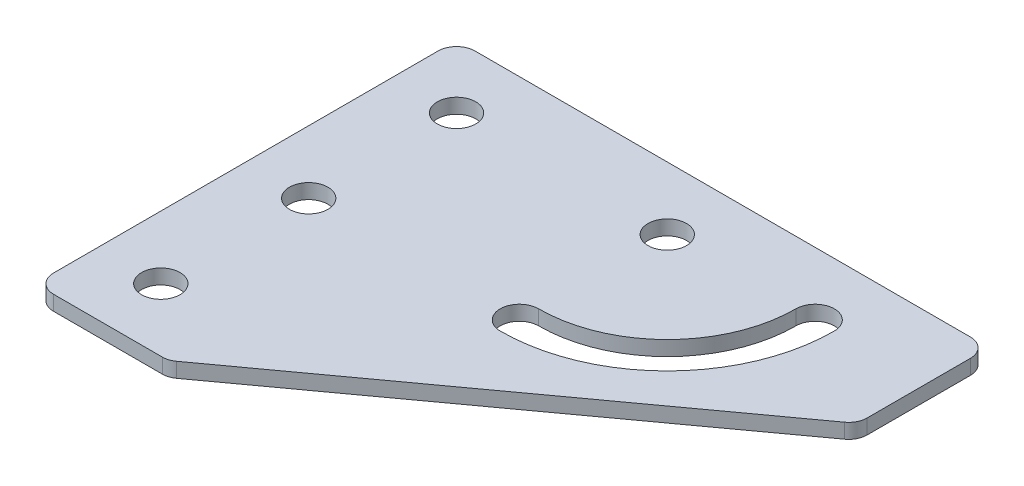
ISO-10303-21;
HEADER;
FILE_DESCRIPTION(('STEP AP214'),'2;1');
FILE_NAME('part.step','',(''),(''),'','','');
FILE_SCHEMA(('AUTOMOTIVE_DESIGN { 1 0 10303 214 1 1 1 1 }'));
ENDSEC;
DATA;
#1=APPLICATION_CONTEXT('core data for automotive mechanical design processes');
#2=APPLICATION_PROTOCOL_DEFINITION('international standard','automotive_design',2000,#1);
#3=PRODUCT_CONTEXT('',#1,'mechanical');
#4=PRODUCT('Part','Part','',(#3));
#5=PRODUCT_RELATED_PRODUCT_CATEGORY('part','',(#4));
#6=PRODUCT_DEFINITION_FORMATION('','',#4);
#7=PRODUCT_DEFINITION_CONTEXT('part definition',#1,'design');
#8=PRODUCT_DEFINITION('design','',#6,#7);
#9=PRODUCT_DEFINITION_SHAPE('','',#8);
#10=(LENGTH_UNIT() NAMED_UNIT(*) SI_UNIT(.MILLI.,.METRE.));
#11=(NAMED_UNIT(*) PLANE_ANGLE_UNIT() SI_UNIT($,.RADIAN.));
#12=(NAMED_UNIT(*) SI_UNIT($,.STERADIAN.) SOLID_ANGLE_UNIT());
#13=UNCERTAINTY_MEASURE_WITH_UNIT(LENGTH_MEASURE(1.E-05),#10,'distance_accuracy_value','');
#14=(GEOMETRIC_REPRESENTATION_CONTEXT(3) GLOBAL_UNCERTAINTY_ASSIGNED_CONTEXT((#13)) GLOBAL_UNIT_ASSIGNED_CONTEXT((#10,
#11,#12)) REPRESENTATION_CONTEXT('',''));
#15=CARTESIAN_POINT('',(0.,0.,0.));
#16=DIRECTION('',(0.,0.,1.));
#17=DIRECTION('',(1.,0.,0.));
#18=AXIS2_PLACEMENT_3D('',#15,#16,#17);
#19=CARTESIAN_POINT('',(0.,0.,0.));
#20=DIRECTION('',(0.,-1.,0.));
#21=DIRECTION('',(0.,0.,-1.));
#22=AXIS2_PLACEMENT_3D('',#19,#20,#21);
#23=PLANE('',#22);
#24=CARTESIAN_POINT('',(28.5,0.,20.));
#25=DIRECTION('',(0.,1.,0.));
#26=DIRECTION('',(0.,0.,1.));
#27=AXIS2_PLACEMENT_3D('',#24,#25,#26);
#28=CIRCLE('',#27,2.6);
#29=CARTESIAN_POINT('',(28.5,0.,17.4));
#30=VERTEX_POINT('',#29);
#31=CARTESIAN_POINT('',(28.5,0.,22.6));
#32=VERTEX_POINT('',#31);
#33=EDGE_CURVE('E122',#30,#32,#28,.T.);
#34=ORIENTED_EDGE('',*,*,#33,.T.);
#35=CARTESIAN_POINT('',(28.4999999999999,0.,0.));
#36=DIRECTION('',(0.,1.,0.));
#37=DIRECTION('',(0.,0.,1.));
#38=AXIS2_PLACEMENT_3D('',#35,#36,#37);
#39=CIRCLE('',#38,22.6);
#40=CARTESIAN_POINT('',(51.1,0.,0.));
#41=VERTEX_POINT('',#40);
#42=EDGE_CURVE('E134',#32,#41,#39,.T.);
#43=ORIENTED_EDGE('',*,*,#42,.T.);
#44=CARTESIAN_POINT('',(48.4999999999999,0.,0.));
#45=DIRECTION('',(0.,1.,0.));
#46=DIRECTION('',(0.,0.,1.));
#47=AXIS2_PLACEMENT_3D('',#44,#45,#46);
#48=CIRCLE('',#47,2.6);
#49=CARTESIAN_POINT('',(45.8999999999999,0.,0.));
#50=VERTEX_POINT('',#49);
#51=EDGE_CURVE('E138',#41,#50,#48,.T.);
#52=ORIENTED_EDGE('',*,*,#51,.T.);
#53=CARTESIAN_POINT('',(28.4999999999999,0.,0.));
#54=DIRECTION('',(0.,-1.,0.));
#55=DIRECTION('',(0.,0.,1.));
#56=AXIS2_PLACEMENT_3D('',#53,#54,#55);
#57=CIRCLE('',#56,17.4);
#58=EDGE_CURVE('E130',#50,#30,#57,.T.);
#59=ORIENTED_EDGE('',*,*,#58,.T.);
#60=EDGE_LOOP('',(#34,#43,#52,#59));
#61=FACE_BOUND('',#60,.T.);
#62=CARTESIAN_POINT('',(0.,0.,40.));
#63=DIRECTION('',(0.,1.,0.));
#64=DIRECTION('',(0.,0.,1.));
#65=AXIS2_PLACEMENT_3D('',#62,#63,#64);
#66=CIRCLE('',#65,2.6);
#67=CARTESIAN_POINT('',(0.,0.,42.6));
#68=VERTEX_POINT('',#67);
#69=EDGE_CURVE('E161',#68,#68,#66,.T.);
#70=ORIENTED_EDGE('',*,*,#69,.T.);
#71=EDGE_LOOP('',(#70));
#72=FACE_BOUND('',#71,.T.);
#73=CARTESIAN_POINT('',(0.,0.,20.));
#74=DIRECTION('',(0.,1.,0.));
#75=DIRECTION('',(0.,0.,1.));
#76=AXIS2_PLACEMENT_3D('',#73,#74,#75);
#77=CIRCLE('',#76,2.6);
#78=CARTESIAN_POINT('',(0.,0.,22.6));
#79=VERTEX_POINT('',#78);
#80=EDGE_CURVE('E167',#79,#79,#77,.T.);
#81=ORIENTED_EDGE('',*,*,#80,.T.);
#82=EDGE_LOOP('',(#81));
#83=FACE_BOUND('',#82,.T.);
#84=CARTESIAN_POINT('',(28.4999999999999,0.,0.));
#85=DIRECTION('',(0.,1.,0.));
#86=DIRECTION('',(0.,0.,1.));
#87=AXIS2_PLACEMENT_3D('',#84,#85,#86);
#88=CIRCLE('',#87,2.59999999999999);
#89=CARTESIAN_POINT('',(28.4999999999999,0.,2.6));
#90=VERTEX_POINT('',#89);
#91=EDGE_CURVE('E173',#90,#90,#88,.T.);
#92=ORIENTED_EDGE('',*,*,#91,.T.);
#93=EDGE_LOOP('',(#92));
#94=FACE_BOUND('',#93,.T.);
#95=CARTESIAN_POINT('',(0.,0.,0.));
#96=DIRECTION('',(0.,1.,0.));
#97=DIRECTION('',(0.,0.,1.));
#98=AXIS2_PLACEMENT_3D('',#95,#96,#97);
#99=CIRCLE('',#98,2.6);
#100=CARTESIAN_POINT('',(0.,0.,2.6));
#101=VERTEX_POINT('',#100);
#102=EDGE_CURVE('E179',#101,#101,#99,.T.);
#103=ORIENTED_EDGE('',*,*,#102,.T.);
#104=EDGE_LOOP('',(#103));
#105=FACE_BOUND('',#104,.T.);
#106=DIRECTION('',(1.,0.,0.));
#107=VECTOR('',#106,1.);
#108=CARTESIAN_POINT('',(-8.50000000000006,0.,48.5));
#109=LINE('',#108,#107);
#110=CARTESIAN_POINT('',(-6.00000000000006,0.,48.5));
#111=VERTEX_POINT('',#110);
#112=CARTESIAN_POINT('',(8.69926474563234,0.,48.5));
#113=VERTEX_POINT('',#112);
#114=EDGE_CURVE('E192',#111,#113,#109,.T.);
#115=ORIENTED_EDGE('',*,*,#114,.F.);
#116=CARTESIAN_POINT('',(-6.00000000000006,0.,46.));
#117=DIRECTION('',(0.,-1.,0.));
#118=DIRECTION('',(0.,0.,-1.));
#119=AXIS2_PLACEMENT_3D('',#116,#117,#118);
#120=CIRCLE('',#119,2.5);
#121=CARTESIAN_POINT('',(-8.50000000000006,0.,46.));
#122=VERTEX_POINT('',#121);
#123=EDGE_CURVE('E240',#111,#122,#120,.T.);
#124=ORIENTED_EDGE('',*,*,#123,.T.);
#125=DIRECTION('',(0.,0.,1.));
#126=VECTOR('',#125,1.);
#127=CARTESIAN_POINT('',(-8.50000000000006,0.,-8.50000000000004));
#128=LINE('',#127,#126);
#129=CARTESIAN_POINT('',(-8.50000000000006,0.,-6.00000000000004));
#130=VERTEX_POINT('',#129);
#131=EDGE_CURVE('E188',#130,#122,#128,.T.);
#132=ORIENTED_EDGE('',*,*,#131,.F.);
#133=CARTESIAN_POINT('',(-6.00000000000006,0.,-6.00000000000004));
#134=DIRECTION('',(0.,-1.,0.));
#135=DIRECTION('',(0.,0.,-1.));
#136=AXIS2_PLACEMENT_3D('',#133,#134,#135);
#137=CIRCLE('',#136,2.5);
#138=CARTESIAN_POINT('',(-6.00000000000006,0.,-8.50000000000004));
#139=VERTEX_POINT('',#138);
#140=EDGE_CURVE('E236',#130,#139,#137,.T.);
#141=ORIENTED_EDGE('',*,*,#140,.T.);
#142=DIRECTION('',(-1.,0.,0.));
#143=VECTOR('',#142,1.);
#144=CARTESIAN_POINT('',(63.4999999999999,0.,-8.50000000000005));
#145=LINE('',#144,#143);
#146=CARTESIAN_POINT('',(60.9999999999999,0.,-8.50000000000005));
#147=VERTEX_POINT('',#146);
#148=EDGE_CURVE('E185',#147,#139,#145,.T.);
#149=ORIENTED_EDGE('',*,*,#148,.F.);
#150=CARTESIAN_POINT('',(60.9999999999999,0.,-6.00000000000005));
#151=DIRECTION('',(0.,-1.,0.));
#152=DIRECTION('',(0.,0.,-1.));
#153=AXIS2_PLACEMENT_3D('',#150,#151,#152);
#154=CIRCLE('',#153,2.5);
#155=CARTESIAN_POINT('',(63.4999999999999,0.,-6.00000000000005));
#156=VERTEX_POINT('',#155);
#157=EDGE_CURVE('E238',#147,#156,#154,.T.);
#158=ORIENTED_EDGE('',*,*,#157,.T.);
#159=DIRECTION('',(0.,0.,-1.));
#160=VECTOR('',#159,1.);
#161=CARTESIAN_POINT('',(63.4999999999999,0.,9.23616311244519));
#162=LINE('',#161,#160);
#163=CARTESIAN_POINT('',(63.4999999999999,0.,7.96310163318714));
#164=VERTEX_POINT('',#163);
#165=EDGE_CURVE('E197',#164,#156,#162,.T.);
#166=ORIENTED_EDGE('',*,*,#165,.F.);
#167=CARTESIAN_POINT('',(61.,0.,7.96310163318714));
#168=DIRECTION('',(0.,-1.,0.));
#169=DIRECTION('',(0.,0.,-1.));
#170=AXIS2_PLACEMENT_3D('',#167,#168,#169);
#171=CIRCLE('',#170,2.5);
#172=CARTESIAN_POINT('',(62.4704292441876,0.,9.9849418439451));
#173=VERTEX_POINT('',#172);
#174=EDGE_CURVE('E31',#164,#173,#171,.T.);
#175=ORIENTED_EDGE('',*,*,#174,.T.);
#176=DIRECTION('',(0.808736084303189,0.,-0.588171697675046));
#177=VECTOR('',#176,1.);
#178=CARTESIAN_POINT('',(9.51222427961216,0.,48.5));
#179=LINE('',#178,#177);
#180=CARTESIAN_POINT('',(10.16969398982,0.,48.0218402107579));
#181=VERTEX_POINT('',#180);
#182=EDGE_CURVE('E195',#181,#173,#179,.T.);
#183=ORIENTED_EDGE('',*,*,#182,.F.);
#184=CARTESIAN_POINT('',(8.69926474563234,0.,46.));
#185=DIRECTION('',(0.,-1.,0.));
#186=DIRECTION('',(0.,0.,-1.));
#187=AXIS2_PLACEMENT_3D('',#184,#185,#186);
#188=CIRCLE('',#187,2.5);
#189=EDGE_CURVE('E233',#181,#113,#188,.T.);
#190=ORIENTED_EDGE('',*,*,#189,.T.);
#191=EDGE_LOOP('',(#115,#124,#132,#141,#149,#158,#166,#175,#183,#190));
#192=FACE_BOUND('',#191,.T.);
#193=ADVANCED_FACE('F16',(#61,#72,#83,#94,#105,#192),#23,.T.);
#194=CARTESIAN_POINT('',(63.4999999999999,0.,-8.50000000000005));
#195=DIRECTION('',(0.,0.,-1.));
#196=DIRECTION('',(-1.,0.,0.));
#197=AXIS2_PLACEMENT_3D('',#194,#195,#196);
#198=PLANE('',#197);
#199=DIRECTION('',(-1.,0.,0.));
#200=VECTOR('',#199,1.);
#201=CARTESIAN_POINT('',(63.4999999999999,2.,-8.50000000000005));
#202=LINE('',#201,#200);
#203=CARTESIAN_POINT('',(60.9999999999999,2.,-8.50000000000005));
#204=VERTEX_POINT('',#203);
#205=CARTESIAN_POINT('',(-6.00000000000006,2.,-8.50000000000004));
#206=VERTEX_POINT('',#205);
#207=EDGE_CURVE('E182',#204,#206,#202,.T.);
#208=ORIENTED_EDGE('',*,*,#207,.F.);
#209=DIRECTION('',(0.,1.,0.));
#210=VECTOR('',#209,1.);
#211=CARTESIAN_POINT('',(60.9999999999999,0.,-8.50000000000005));
#212=LINE('',#211,#210);
#213=EDGE_CURVE('E250',#204,#147,#212,.F.);
#214=ORIENTED_EDGE('',*,*,#213,.T.);
#215=ORIENTED_EDGE('',*,*,#148,.T.);
#216=DIRECTION('',(0.,1.,0.));
#217=VECTOR('',#216,1.);
#218=CARTESIAN_POINT('',(-6.00000000000006,0.,-8.50000000000004));
#219=LINE('',#218,#217);
#220=EDGE_CURVE('E247',#139,#206,#219,.T.);
#221=ORIENTED_EDGE('',*,*,#220,.T.);
#222=EDGE_LOOP('',(#208,#214,#215,#221));
#223=FACE_BOUND('',#222,.T.);
#224=ADVANCED_FACE('F255',(#223),#198,.T.);
#225=CARTESIAN_POINT('',(63.4999999999999,0.,9.23616311244519));
#226=DIRECTION('',(1.,0.,0.));
#227=DIRECTION('',(0.,0.,-1.));
#228=AXIS2_PLACEMENT_3D('',#225,#226,#227);
#229=PLANE('',#228);
#230=ORIENTED_EDGE('',*,*,#165,.T.);
#231=DIRECTION('',(0.,1.,0.));
#232=VECTOR('',#231,1.);
#233=CARTESIAN_POINT('',(63.4999999999999,0.,-6.00000000000005));
#234=LINE('',#233,#232);
#235=CARTESIAN_POINT('',(63.4999999999999,2.,-6.00000000000005));
#236=VERTEX_POINT('',#235);
#237=EDGE_CURVE('E244',#156,#236,#234,.T.);
#238=ORIENTED_EDGE('',*,*,#237,.T.);
#239=DIRECTION('',(0.,0.,-1.));
#240=VECTOR('',#239,1.);
#241=CARTESIAN_POINT('',(63.4999999999999,2.,9.23616311244519));
#242=LINE('',#241,#240);
#243=CARTESIAN_POINT('',(63.4999999999999,2.,7.96310163318714));
#244=VERTEX_POINT('',#243);
#245=EDGE_CURVE('E189',#244,#236,#242,.T.);
#246=ORIENTED_EDGE('',*,*,#245,.F.);
#247=DIRECTION('',(0.,1.,0.));
#248=VECTOR('',#247,1.);
#249=CARTESIAN_POINT('',(63.4999999999999,0.,7.96310163318714));
#250=LINE('',#249,#248);
#251=EDGE_CURVE('E242',#244,#164,#250,.F.);
#252=ORIENTED_EDGE('',*,*,#251,.T.);
#253=EDGE_LOOP('',(#230,#238,#246,#252));
#254=FACE_BOUND('',#253,.T.);
#255=ADVANCED_FACE('F266',(#254),#229,.T.);
#256=CARTESIAN_POINT('',(9.51222427961216,0.,48.5));
#257=DIRECTION('',(0.588171697675046,0.,0.808736084303188));
#258=DIRECTION('',(0.808736084303189,0.,-0.588171697675046));
#259=AXIS2_PLACEMENT_3D('',#256,#257,#258);
#260=PLANE('',#259);
#261=ORIENTED_EDGE('',*,*,#182,.T.);
#262=DIRECTION('',(0.,1.,0.));
#263=VECTOR('',#262,1.);
#264=CARTESIAN_POINT('',(62.4704292441876,0.,9.9849418439451));
#265=LINE('',#264,#263);
#266=CARTESIAN_POINT('',(62.4704292441876,2.,9.9849418439451));
#267=VERTEX_POINT('',#266);
#268=EDGE_CURVE('E10',#173,#267,#265,.T.);
#269=ORIENTED_EDGE('',*,*,#268,.T.);
#270=DIRECTION('',(0.808736084303189,0.,-0.588171697675046));
#271=VECTOR('',#270,1.);
#272=CARTESIAN_POINT('',(9.51222427961216,2.,48.5));
#273=LINE('',#272,#271);
#274=CARTESIAN_POINT('',(10.16969398982,2.,48.0218402107579));
#275=VERTEX_POINT('',#274);
#276=EDGE_CURVE('E209',#275,#267,#273,.T.);
#277=ORIENTED_EDGE('',*,*,#276,.F.);
#278=DIRECTION('',(0.,1.,0.));
#279=VECTOR('',#278,1.);
#280=CARTESIAN_POINT('',(10.16969398982,0.,48.0218402107579));
#281=LINE('',#280,#279);
#282=EDGE_CURVE('E24',#275,#181,#281,.F.);
#283=ORIENTED_EDGE('',*,*,#282,.T.);
#284=EDGE_LOOP('',(#261,#269,#277,#283));
#285=FACE_BOUND('',#284,.T.);
#286=ADVANCED_FACE('F273',(#285),#260,.T.);
#287=CARTESIAN_POINT('',(-8.50000000000006,0.,48.5));
#288=DIRECTION('',(0.,0.,1.));
#289=DIRECTION('',(1.,0.,0.));
#290=AXIS2_PLACEMENT_3D('',#287,#288,#289);
#291=PLANE('',#290);
#292=DIRECTION('',(1.,0.,0.));
#293=VECTOR('',#292,1.);
#294=CARTESIAN_POINT('',(-8.50000000000006,2.,48.5));
#295=LINE('',#294,#293);
#296=CARTESIAN_POINT('',(-6.00000000000006,2.,48.5));
#297=VERTEX_POINT('',#296);
#298=CARTESIAN_POINT('',(8.69926474563234,2.,48.5));
#299=VERTEX_POINT('',#298);
#300=EDGE_CURVE('E206',#297,#299,#295,.T.);
#301=ORIENTED_EDGE('',*,*,#300,.F.);
#302=DIRECTION('',(0.,1.,0.));
#303=VECTOR('',#302,1.);
#304=CARTESIAN_POINT('',(-6.00000000000006,0.,48.5));
#305=LINE('',#304,#303);
#306=EDGE_CURVE('E231',#297,#111,#305,.F.);
#307=ORIENTED_EDGE('',*,*,#306,.T.);
#308=ORIENTED_EDGE('',*,*,#114,.T.);
#309=DIRECTION('',(0.,1.,0.));
#310=VECTOR('',#309,1.);
#311=CARTESIAN_POINT('',(8.69926474563234,0.,48.5));
#312=LINE('',#311,#310);
#313=EDGE_CURVE('E228',#113,#299,#312,.T.);
#314=ORIENTED_EDGE('',*,*,#313,.T.);
#315=EDGE_LOOP('',(#301,#307,#308,#314));
#316=FACE_BOUND('',#315,.T.);
#317=ADVANCED_FACE('F279',(#316),#291,.T.);
#318=CARTESIAN_POINT('',(-8.50000000000006,0.,-8.50000000000004));
#319=DIRECTION('',(-1.,0.,0.));
#320=DIRECTION('',(0.,0.,1.));
#321=AXIS2_PLACEMENT_3D('',#318,#319,#320);
#322=PLANE('',#321);
#323=ORIENTED_EDGE('',*,*,#131,.T.);
#324=DIRECTION('',(0.,1.,0.));
#325=VECTOR('',#324,1.);
#326=CARTESIAN_POINT('',(-8.50000000000006,0.,46.));
#327=LINE('',#326,#325);
#328=CARTESIAN_POINT('',(-8.50000000000006,2.,46.));
#329=VERTEX_POINT('',#328);
#330=EDGE_CURVE('E215',#122,#329,#327,.T.);
#331=ORIENTED_EDGE('',*,*,#330,.T.);
#332=DIRECTION('',(0.,0.,1.));
#333=VECTOR('',#332,1.);
#334=CARTESIAN_POINT('',(-8.50000000000006,2.,-8.50000000000004));
#335=LINE('',#334,#333);
#336=CARTESIAN_POINT('',(-8.50000000000006,2.,-6.00000000000004));
#337=VERTEX_POINT('',#336);
#338=EDGE_CURVE('E203',#337,#329,#335,.T.);
#339=ORIENTED_EDGE('',*,*,#338,.F.);
#340=DIRECTION('',(0.,1.,0.));
#341=VECTOR('',#340,1.);
#342=CARTESIAN_POINT('',(-8.50000000000006,0.,-6.00000000000004));
#343=LINE('',#342,#341);
#344=EDGE_CURVE('E200',#337,#130,#343,.F.);
#345=ORIENTED_EDGE('',*,*,#344,.T.);
#346=EDGE_LOOP('',(#323,#331,#339,#345));
#347=FACE_BOUND('',#346,.T.);
#348=ADVANCED_FACE('F287',(#347),#322,.T.);
#349=CARTESIAN_POINT('',(0.,2.,0.));
#350=DIRECTION('',(0.,-1.,0.));
#351=DIRECTION('',(0.,0.,-1.));
#352=AXIS2_PLACEMENT_3D('',#349,#350,#351);
#353=PLANE('',#352);
#354=CARTESIAN_POINT('',(28.4999999999999,2.,0.));
#355=DIRECTION('',(0.,1.,0.));
#356=DIRECTION('',(0.,0.,1.));
#357=AXIS2_PLACEMENT_3D('',#354,#355,#356);
#358=CIRCLE('',#357,22.6);
#359=CARTESIAN_POINT('',(28.5,2.,22.6));
#360=VERTEX_POINT('',#359);
#361=CARTESIAN_POINT('',(51.1,2.,0.));
#362=VERTEX_POINT('',#361);
#363=EDGE_CURVE('E151',#360,#362,#358,.T.);
#364=ORIENTED_EDGE('',*,*,#363,.F.);
#365=CARTESIAN_POINT('',(28.5,2.,20.));
#366=DIRECTION('',(0.,1.,0.));
#367=DIRECTION('',(0.,0.,1.));
#368=AXIS2_PLACEMENT_3D('',#365,#366,#367);
#369=CIRCLE('',#368,2.6);
#370=CARTESIAN_POINT('',(28.5,2.,17.4));
#371=VERTEX_POINT('',#370);
#372=EDGE_CURVE('E125',#371,#360,#369,.T.);
#373=ORIENTED_EDGE('',*,*,#372,.F.);
#374=CARTESIAN_POINT('',(28.4999999999999,2.,0.));
#375=DIRECTION('',(0.,-1.,0.));
#376=DIRECTION('',(0.,0.,1.));
#377=AXIS2_PLACEMENT_3D('',#374,#375,#376);
#378=CIRCLE('',#377,17.4);
#379=CARTESIAN_POINT('',(45.8999999999999,2.,0.));
#380=VERTEX_POINT('',#379);
#381=EDGE_CURVE('E142',#380,#371,#378,.T.);
#382=ORIENTED_EDGE('',*,*,#381,.F.);
#383=CARTESIAN_POINT('',(48.4999999999999,2.,0.));
#384=DIRECTION('',(0.,1.,0.));
#385=DIRECTION('',(0.,0.,1.));
#386=AXIS2_PLACEMENT_3D('',#383,#384,#385);
#387=CIRCLE('',#386,2.6);
#388=EDGE_CURVE('E145',#362,#380,#387,.T.);
#389=ORIENTED_EDGE('',*,*,#388,.F.);
#390=EDGE_LOOP('',(#364,#373,#382,#389));
#391=FACE_BOUND('',#390,.T.);
#392=CARTESIAN_POINT('',(0.,2.,40.));
#393=DIRECTION('',(0.,1.,0.));
#394=DIRECTION('',(0.,0.,1.));
#395=AXIS2_PLACEMENT_3D('',#392,#393,#394);
#396=CIRCLE('',#395,2.6);
#397=CARTESIAN_POINT('',(0.,2.,42.6));
#398=VERTEX_POINT('',#397);
#399=EDGE_CURVE('E157',#398,#398,#396,.T.);
#400=ORIENTED_EDGE('',*,*,#399,.F.);
#401=EDGE_LOOP('',(#400));
#402=FACE_BOUND('',#401,.T.);
#403=CARTESIAN_POINT('',(0.,2.,20.));
#404=DIRECTION('',(0.,1.,0.));
#405=DIRECTION('',(0.,0.,1.));
#406=AXIS2_PLACEMENT_3D('',#403,#404,#405);
#407=CIRCLE('',#406,2.6);
#408=CARTESIAN_POINT('',(0.,2.,22.6));
#409=VERTEX_POINT('',#408);
#410=EDGE_CURVE('E164',#409,#409,#407,.T.);
#411=ORIENTED_EDGE('',*,*,#410,.F.);
#412=EDGE_LOOP('',(#411));
#413=FACE_BOUND('',#412,.T.);
#414=CARTESIAN_POINT('',(28.4999999999999,2.,0.));
#415=DIRECTION('',(0.,1.,0.));
#416=DIRECTION('',(0.,0.,1.));
#417=AXIS2_PLACEMENT_3D('',#414,#415,#416);
#418=CIRCLE('',#417,2.59999999999999);
#419=CARTESIAN_POINT('',(28.4999999999999,2.,2.6));
#420=VERTEX_POINT('',#419);
#421=EDGE_CURVE('E170',#420,#420,#418,.T.);
#422=ORIENTED_EDGE('',*,*,#421,.F.);
#423=EDGE_LOOP('',(#422));
#424=FACE_BOUND('',#423,.T.);
#425=CARTESIAN_POINT('',(0.,2.,0.));
#426=DIRECTION('',(0.,1.,0.));
#427=DIRECTION('',(0.,0.,1.));
#428=AXIS2_PLACEMENT_3D('',#425,#426,#427);
#429=CIRCLE('',#428,2.6);
#430=CARTESIAN_POINT('',(0.,2.,2.6));
#431=VERTEX_POINT('',#430);
#432=EDGE_CURVE('E176',#431,#431,#429,.T.);
#433=ORIENTED_EDGE('',*,*,#432,.F.);
#434=EDGE_LOOP('',(#433));
#435=FACE_BOUND('',#434,.T.);
#436=ORIENTED_EDGE('',*,*,#338,.T.);
#437=CARTESIAN_POINT('',(-6.00000000000006,2.,46.));
#438=DIRECTION('',(0.,-1.,0.));
#439=DIRECTION('',(0.,0.,-1.));
#440=AXIS2_PLACEMENT_3D('',#437,#438,#439);
#441=CIRCLE('',#440,2.5);
#442=EDGE_CURVE('E226',#329,#297,#441,.F.);
#443=ORIENTED_EDGE('',*,*,#442,.T.);
#444=ORIENTED_EDGE('',*,*,#300,.T.);
#445=CARTESIAN_POINT('',(8.69926474563234,2.,46.));
#446=DIRECTION('',(0.,-1.,0.));
#447=DIRECTION('',(0.,0.,-1.));
#448=AXIS2_PLACEMENT_3D('',#445,#446,#447);
#449=CIRCLE('',#448,2.5);
#450=EDGE_CURVE('E218',#299,#275,#449,.F.);
#451=ORIENTED_EDGE('',*,*,#450,.T.);
#452=ORIENTED_EDGE('',*,*,#276,.T.);
#453=CARTESIAN_POINT('',(61.,2.,7.96310163318714));
#454=DIRECTION('',(0.,-1.,0.));
#455=DIRECTION('',(0.,0.,-1.));
#456=AXIS2_PLACEMENT_3D('',#453,#454,#455);
#457=CIRCLE('',#456,2.5);
#458=EDGE_CURVE('E220',#267,#244,#457,.F.);
#459=ORIENTED_EDGE('',*,*,#458,.T.);
#460=ORIENTED_EDGE('',*,*,#245,.T.);
#461=CARTESIAN_POINT('',(60.9999999999999,2.,-6.00000000000005));
#462=DIRECTION('',(0.,-1.,0.));
#463=DIRECTION('',(0.,0.,-1.));
#464=AXIS2_PLACEMENT_3D('',#461,#462,#463);
#465=CIRCLE('',#464,2.5);
#466=EDGE_CURVE('E224',#236,#204,#465,.F.);
#467=ORIENTED_EDGE('',*,*,#466,.T.);
#468=ORIENTED_EDGE('',*,*,#207,.T.);
#469=CARTESIAN_POINT('',(-6.00000000000006,2.,-6.00000000000004));
#470=DIRECTION('',(0.,-1.,0.));
#471=DIRECTION('',(0.,0.,-1.));
#472=AXIS2_PLACEMENT_3D('',#469,#470,#471);
#473=CIRCLE('',#472,2.5);
#474=EDGE_CURVE('E222',#206,#337,#473,.F.);
#475=ORIENTED_EDGE('',*,*,#474,.T.);
#476=EDGE_LOOP('',(#436,#443,#444,#451,#452,#459,#460,#467,#468,#475));
#477=FACE_BOUND('',#476,.T.);
#478=ADVANCED_FACE('F269',(#391,#402,#413,#424,#435,#477),#353,.F.);
#479=CARTESIAN_POINT('',(0.,0.,0.));
#480=DIRECTION('',(0.,1.,0.));
#481=DIRECTION('',(0.,0.,1.));
#482=AXIS2_PLACEMENT_3D('',#479,#480,#481);
#483=CYLINDRICAL_SURFACE('',#482,2.6);
#484=ORIENTED_EDGE('',*,*,#102,.F.);
#485=EDGE_LOOP('',(#484));
#486=FACE_BOUND('',#485,.T.);
#487=ORIENTED_EDGE('',*,*,#432,.T.);
#488=EDGE_LOOP('',(#487));
#489=FACE_BOUND('',#488,.T.);
#490=ADVANCED_FACE('F334',(#486,#489),#483,.F.);
#491=CARTESIAN_POINT('',(28.4999999999999,0.,0.));
#492=DIRECTION('',(0.,1.,0.));
#493=DIRECTION('',(0.,0.,1.));
#494=AXIS2_PLACEMENT_3D('',#491,#492,#493);
#495=CYLINDRICAL_SURFACE('',#494,2.59999999999999);
#496=ORIENTED_EDGE('',*,*,#91,.F.);
#497=EDGE_LOOP('',(#496));
#498=FACE_BOUND('',#497,.T.);
#499=ORIENTED_EDGE('',*,*,#421,.T.);
#500=EDGE_LOOP('',(#499));
#501=FACE_BOUND('',#500,.T.);
#502=ADVANCED_FACE('F330',(#498,#501),#495,.F.);
#503=CARTESIAN_POINT('',(0.,0.,20.));
#504=DIRECTION('',(0.,1.,0.));
#505=DIRECTION('',(0.,0.,1.));
#506=AXIS2_PLACEMENT_3D('',#503,#504,#505);
#507=CYLINDRICAL_SURFACE('',#506,2.6);
#508=ORIENTED_EDGE('',*,*,#80,.F.);
#509=EDGE_LOOP('',(#508));
#510=FACE_BOUND('',#509,.T.);
#511=ORIENTED_EDGE('',*,*,#410,.T.);
#512=EDGE_LOOP('',(#511));
#513=FACE_BOUND('',#512,.T.);
#514=ADVANCED_FACE('F326',(#510,#513),#507,.F.);
#515=CARTESIAN_POINT('',(0.,0.,40.));
#516=DIRECTION('',(0.,1.,0.));
#517=DIRECTION('',(0.,0.,1.));
#518=AXIS2_PLACEMENT_3D('',#515,#516,#517);
#519=CYLINDRICAL_SURFACE('',#518,2.6);
#520=ORIENTED_EDGE('',*,*,#69,.F.);
#521=EDGE_LOOP('',(#520));
#522=FACE_BOUND('',#521,.T.);
#523=ORIENTED_EDGE('',*,*,#399,.T.);
#524=EDGE_LOOP('',(#523));
#525=FACE_BOUND('',#524,.T.);
#526=ADVANCED_FACE('F323',(#522,#525),#519,.F.);
#527=CARTESIAN_POINT('',(28.5,0.,20.));
#528=DIRECTION('',(0.,1.,0.));
#529=DIRECTION('',(0.,0.,1.));
#530=AXIS2_PLACEMENT_3D('',#527,#528,#529);
#531=CYLINDRICAL_SURFACE('',#530,2.6);
#532=ORIENTED_EDGE('',*,*,#372,.T.);
#533=DIRECTION('',(0.,1.,0.));
#534=VECTOR('',#533,1.);
#535=CARTESIAN_POINT('',(28.5,0.,22.6));
#536=LINE('',#535,#534);
#537=EDGE_CURVE('E118',#32,#360,#536,.T.);
#538=ORIENTED_EDGE('',*,*,#537,.F.);
#539=ORIENTED_EDGE('',*,*,#33,.F.);
#540=DIRECTION('',(0.,1.,0.));
#541=VECTOR('',#540,1.);
#542=CARTESIAN_POINT('',(28.5,0.,17.4));
#543=LINE('',#542,#541);
#544=EDGE_CURVE('E155',#30,#371,#543,.T.);
#545=ORIENTED_EDGE('',*,*,#544,.T.);
#546=EDGE_LOOP('',(#532,#538,#539,#545));
#547=FACE_BOUND('',#546,.T.);
#548=ADVANCED_FACE('F120',(#547),#531,.F.);
#549=CARTESIAN_POINT('',(28.4999999999999,0.,0.));
#550=DIRECTION('',(0.,1.,0.));
#551=DIRECTION('',(0.,0.,1.));
#552=AXIS2_PLACEMENT_3D('',#549,#550,#551);
#553=CYLINDRICAL_SURFACE('',#552,17.4);
#554=ORIENTED_EDGE('',*,*,#381,.T.);
#555=ORIENTED_EDGE('',*,*,#544,.F.);
#556=ORIENTED_EDGE('',*,*,#58,.F.);
#557=DIRECTION('',(0.,1.,0.));
#558=VECTOR('',#557,1.);
#559=CARTESIAN_POINT('',(45.8999999999999,0.,0.));
#560=LINE('',#559,#558);
#561=EDGE_CURVE('E158',#50,#380,#560,.T.);
#562=ORIENTED_EDGE('',*,*,#561,.T.);
#563=EDGE_LOOP('',(#554,#555,#556,#562));
#564=FACE_BOUND('',#563,.T.);
#565=ADVANCED_FACE('F316',(#564),#553,.T.);
#566=CARTESIAN_POINT('',(48.4999999999999,0.,0.));
#567=DIRECTION('',(0.,1.,0.));
#568=DIRECTION('',(0.,0.,1.));
#569=AXIS2_PLACEMENT_3D('',#566,#567,#568);
#570=CYLINDRICAL_SURFACE('',#569,2.6);
#571=ORIENTED_EDGE('',*,*,#388,.T.);
#572=ORIENTED_EDGE('',*,*,#561,.F.);
#573=ORIENTED_EDGE('',*,*,#51,.F.);
#574=DIRECTION('',(0.,1.,0.));
#575=VECTOR('',#574,1.);
#576=CARTESIAN_POINT('',(51.1,0.,0.));
#577=LINE('',#576,#575);
#578=EDGE_CURVE('E129',#41,#362,#577,.T.);
#579=ORIENTED_EDGE('',*,*,#578,.T.);
#580=EDGE_LOOP('',(#571,#572,#573,#579));
#581=FACE_BOUND('',#580,.T.);
#582=ADVANCED_FACE('F311',(#581),#570,.F.);
#583=CARTESIAN_POINT('',(28.4999999999999,0.,0.));
#584=DIRECTION('',(0.,1.,0.));
#585=DIRECTION('',(0.,0.,1.));
#586=AXIS2_PLACEMENT_3D('',#583,#584,#585);
#587=CYLINDRICAL_SURFACE('',#586,22.6);
#588=ORIENTED_EDGE('',*,*,#363,.T.);
#589=ORIENTED_EDGE('',*,*,#578,.F.);
#590=ORIENTED_EDGE('',*,*,#42,.F.);
#591=ORIENTED_EDGE('',*,*,#537,.T.);
#592=EDGE_LOOP('',(#588,#589,#590,#591));
#593=FACE_BOUND('',#592,.T.);
#594=ADVANCED_FACE('F135',(#593),#587,.F.);
#595=CARTESIAN_POINT('',(-6.00000000000006,0.,46.));
#596=DIRECTION('',(0.,1.,0.));
#597=DIRECTION('',(0.,0.,1.));
#598=AXIS2_PLACEMENT_3D('',#595,#596,#597);
#599=CYLINDRICAL_SURFACE('',#598,2.5);
#600=ORIENTED_EDGE('',*,*,#123,.F.);
#601=ORIENTED_EDGE('',*,*,#306,.F.);
#602=ORIENTED_EDGE('',*,*,#442,.F.);
#603=ORIENTED_EDGE('',*,*,#330,.F.);
#604=EDGE_LOOP('',(#600,#601,#602,#603));
#605=FACE_BOUND('',#604,.T.);
#606=ADVANCED_FACE('F285',(#605),#599,.T.);
#607=CARTESIAN_POINT('',(60.9999999999999,0.,-6.00000000000005));
#608=DIRECTION('',(0.,1.,0.));
#609=DIRECTION('',(0.,0.,1.));
#610=AXIS2_PLACEMENT_3D('',#607,#608,#609);
#611=CYLINDRICAL_SURFACE('',#610,2.5);
#612=ORIENTED_EDGE('',*,*,#157,.F.);
#613=ORIENTED_EDGE('',*,*,#213,.F.);
#614=ORIENTED_EDGE('',*,*,#466,.F.);
#615=ORIENTED_EDGE('',*,*,#237,.F.);
#616=EDGE_LOOP('',(#612,#613,#614,#615));
#617=FACE_BOUND('',#616,.T.);
#618=ADVANCED_FACE('F263',(#617),#611,.T.);
#619=CARTESIAN_POINT('',(-6.00000000000006,0.,-6.00000000000004));
#620=DIRECTION('',(0.,1.,0.));
#621=DIRECTION('',(0.,0.,1.));
#622=AXIS2_PLACEMENT_3D('',#619,#620,#621);
#623=CYLINDRICAL_SURFACE('',#622,2.5);
#624=ORIENTED_EDGE('',*,*,#140,.F.);
#625=ORIENTED_EDGE('',*,*,#344,.F.);
#626=ORIENTED_EDGE('',*,*,#474,.F.);
#627=ORIENTED_EDGE('',*,*,#220,.F.);
#628=EDGE_LOOP('',(#624,#625,#626,#627));
#629=FACE_BOUND('',#628,.T.);
#630=ADVANCED_FACE('F290',(#629),#623,.T.);
#631=CARTESIAN_POINT('',(61.,0.,7.96310163318714));
#632=DIRECTION('',(0.,1.,0.));
#633=DIRECTION('',(0.,0.,1.));
#634=AXIS2_PLACEMENT_3D('',#631,#632,#633);
#635=CYLINDRICAL_SURFACE('',#634,2.5);
#636=ORIENTED_EDGE('',*,*,#174,.F.);
#637=ORIENTED_EDGE('',*,*,#251,.F.);
#638=ORIENTED_EDGE('',*,*,#458,.F.);
#639=ORIENTED_EDGE('',*,*,#268,.F.);
#640=EDGE_LOOP('',(#636,#637,#638,#639));
#641=FACE_BOUND('',#640,.T.);
#642=ADVANCED_FACE('F272',(#641),#635,.T.);
#643=CARTESIAN_POINT('',(8.69926474563234,0.,46.));
#644=DIRECTION('',(0.,1.,0.));
#645=DIRECTION('',(0.,0.,1.));
#646=AXIS2_PLACEMENT_3D('',#643,#644,#645);
#647=CYLINDRICAL_SURFACE('',#646,2.5);
#648=ORIENTED_EDGE('',*,*,#189,.F.);
#649=ORIENTED_EDGE('',*,*,#282,.F.);
#650=ORIENTED_EDGE('',*,*,#450,.F.);
#651=ORIENTED_EDGE('',*,*,#313,.F.);
#652=EDGE_LOOP('',(#648,#649,#650,#651));
#653=FACE_BOUND('',#652,.T.);
#654=ADVANCED_FACE('F18',(#653),#647,.T.);
#655=CLOSED_SHELL('',(#193,#224,#255,#286,#317,#348,#478,#490,#502,#514,#526,#548,#565,#582,
#594,#606,#618,#630,#642,#654));
#656=MANIFOLD_SOLID_BREP('B1',#655);
#657=ADVANCED_BREP_SHAPE_REPRESENTATION('',(#18,#656),#14);
#658=SHAPE_DEFINITION_REPRESENTATION(#9,#657);
ENDSEC;
END-ISO-10303-21;
